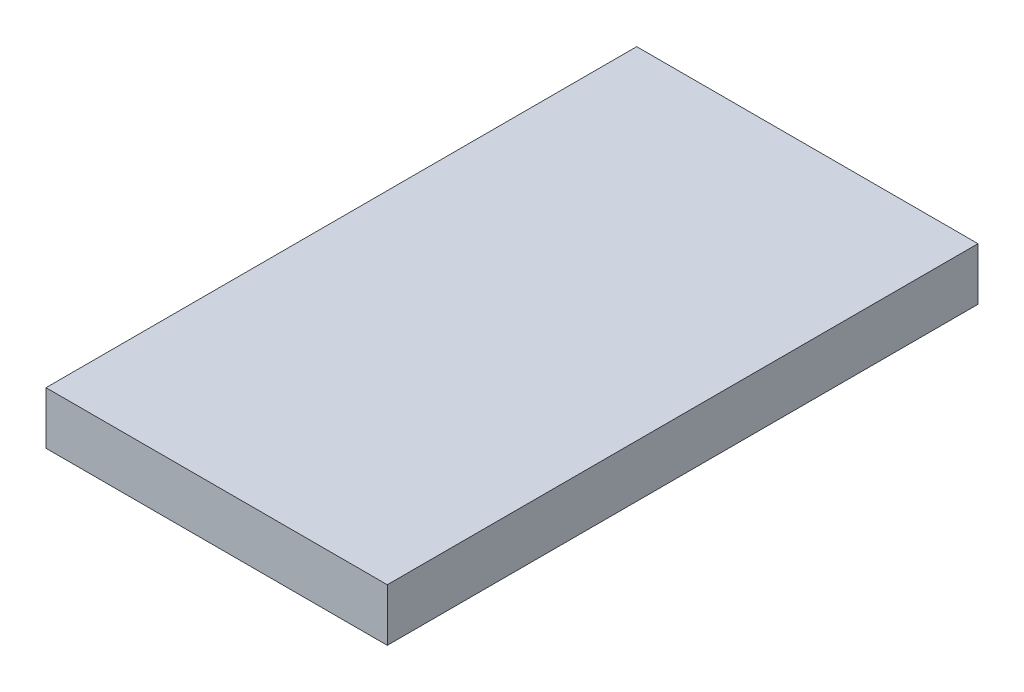
ISO-10303-21;
HEADER;
FILE_DESCRIPTION(('STEP AP214'),'2;1');
FILE_NAME('part.step','',(''),(''),'','','');
FILE_SCHEMA(('AUTOMOTIVE_DESIGN { 1 0 10303 214 1 1 1 1 }'));
ENDSEC;
DATA;
#1=APPLICATION_CONTEXT('core data for automotive mechanical design processes');
#2=APPLICATION_PROTOCOL_DEFINITION('international standard','automotive_design',2000,#1);
#3=PRODUCT_CONTEXT('',#1,'mechanical');
#4=PRODUCT('Part','Part','',(#3));
#5=PRODUCT_RELATED_PRODUCT_CATEGORY('part','',(#4));
#6=PRODUCT_DEFINITION_FORMATION('','',#4);
#7=PRODUCT_DEFINITION_CONTEXT('part definition',#1,'design');
#8=PRODUCT_DEFINITION('design','',#6,#7);
#9=PRODUCT_DEFINITION_SHAPE('','',#8);
#10=(LENGTH_UNIT() NAMED_UNIT(*) SI_UNIT(.MILLI.,.METRE.));
#11=(NAMED_UNIT(*) PLANE_ANGLE_UNIT() SI_UNIT($,.RADIAN.));
#12=(NAMED_UNIT(*) SI_UNIT($,.STERADIAN.) SOLID_ANGLE_UNIT());
#13=UNCERTAINTY_MEASURE_WITH_UNIT(LENGTH_MEASURE(1.E-05),#10,'distance_accuracy_value','');
#14=(GEOMETRIC_REPRESENTATION_CONTEXT(3) GLOBAL_UNCERTAINTY_ASSIGNED_CONTEXT((#13)) GLOBAL_UNIT_ASSIGNED_CONTEXT((#10,
#11,#12)) REPRESENTATION_CONTEXT('',''));
#15=CARTESIAN_POINT('',(0.,0.,0.));
#16=DIRECTION('',(0.,0.,1.));
#17=DIRECTION('',(1.,0.,0.));
#18=AXIS2_PLACEMENT_3D('',#15,#16,#17);
#19=CARTESIAN_POINT('',(5.2,1.6,-9.));
#20=DIRECTION('',(-1.,0.,0.));
#21=DIRECTION('',(0.,0.,1.));
#22=AXIS2_PLACEMENT_3D('',#19,#20,#21);
#23=PLANE('',#22);
#24=DIRECTION('',(0.,0.,-1.));
#25=VECTOR('',#24,1.);
#26=CARTESIAN_POINT('',(5.2,0.,-9.));
#27=LINE('',#26,#25);
#28=CARTESIAN_POINT('',(5.2,0.,9.));
#29=VERTEX_POINT('',#28);
#30=CARTESIAN_POINT('',(5.2,0.,-9.));
#31=VERTEX_POINT('',#30);
#32=EDGE_CURVE('E97',#29,#31,#27,.T.);
#33=ORIENTED_EDGE('',*,*,#32,.T.);
#34=DIRECTION('',(0.,-1.,0.));
#35=VECTOR('',#34,1.);
#36=CARTESIAN_POINT('',(5.2,1.6,-9.));
#37=LINE('',#36,#35);
#38=CARTESIAN_POINT('',(5.2,1.6,-9.));
#39=VERTEX_POINT('',#38);
#40=EDGE_CURVE('E11',#39,#31,#37,.T.);
#41=ORIENTED_EDGE('',*,*,#40,.F.);
#42=DIRECTION('',(0.,0.,-1.));
#43=VECTOR('',#42,1.);
#44=CARTESIAN_POINT('',(5.2,1.6,-9.));
#45=LINE('',#44,#43);
#46=CARTESIAN_POINT('',(5.2,1.6,9.));
#47=VERTEX_POINT('',#46);
#48=EDGE_CURVE('E85',#47,#39,#45,.T.);
#49=ORIENTED_EDGE('',*,*,#48,.F.);
#50=DIRECTION('',(0.,-1.,0.));
#51=VECTOR('',#50,1.);
#52=CARTESIAN_POINT('',(5.2,1.6,9.));
#53=LINE('',#52,#51);
#54=EDGE_CURVE('E93',#47,#29,#53,.T.);
#55=ORIENTED_EDGE('',*,*,#54,.T.);
#56=EDGE_LOOP('',(#33,#41,#49,#55));
#57=FACE_BOUND('',#56,.T.);
#58=ADVANCED_FACE('F34',(#57),#23,.F.);
#59=CARTESIAN_POINT('',(-5.2,1.6,-9.));
#60=DIRECTION('',(0.,0.,1.));
#61=DIRECTION('',(1.,0.,0.));
#62=AXIS2_PLACEMENT_3D('',#59,#60,#61);
#63=PLANE('',#62);
#64=DIRECTION('',(-1.,0.,0.));
#65=VECTOR('',#64,1.);
#66=CARTESIAN_POINT('',(-5.2,0.,-9.));
#67=LINE('',#66,#65);
#68=CARTESIAN_POINT('',(-5.2,0.,-9.));
#69=VERTEX_POINT('',#68);
#70=EDGE_CURVE('E89',#31,#69,#67,.T.);
#71=ORIENTED_EDGE('',*,*,#70,.T.);
#72=DIRECTION('',(0.,-1.,0.));
#73=VECTOR('',#72,1.);
#74=CARTESIAN_POINT('',(-5.2,1.6,-9.));
#75=LINE('',#74,#73);
#76=CARTESIAN_POINT('',(-5.2,1.6,-9.));
#77=VERTEX_POINT('',#76);
#78=EDGE_CURVE('E42',#77,#69,#75,.T.);
#79=ORIENTED_EDGE('',*,*,#78,.F.);
#80=DIRECTION('',(-1.,0.,0.));
#81=VECTOR('',#80,1.);
#82=CARTESIAN_POINT('',(-5.2,1.6,-9.));
#83=LINE('',#82,#81);
#84=EDGE_CURVE('E80',#39,#77,#83,.T.);
#85=ORIENTED_EDGE('',*,*,#84,.F.);
#86=ORIENTED_EDGE('',*,*,#40,.T.);
#87=EDGE_LOOP('',(#71,#79,#85,#86));
#88=FACE_BOUND('',#87,.T.);
#89=ADVANCED_FACE('F88',(#88),#63,.F.);
#90=CARTESIAN_POINT('',(-5.2,1.6,-9.));
#91=DIRECTION('',(1.,0.,0.));
#92=DIRECTION('',(0.,0.,-1.));
#93=AXIS2_PLACEMENT_3D('',#90,#91,#92);
#94=PLANE('',#93);
#95=DIRECTION('',(0.,0.,1.));
#96=VECTOR('',#95,1.);
#97=CARTESIAN_POINT('',(-5.2,0.,-9.));
#98=LINE('',#97,#96);
#99=CARTESIAN_POINT('',(-5.2,0.,9.));
#100=VERTEX_POINT('',#99);
#101=EDGE_CURVE('E67',#69,#100,#98,.T.);
#102=ORIENTED_EDGE('',*,*,#101,.T.);
#103=DIRECTION('',(0.,-1.,0.));
#104=VECTOR('',#103,1.);
#105=CARTESIAN_POINT('',(-5.2,1.6,9.));
#106=LINE('',#105,#104);
#107=CARTESIAN_POINT('',(-5.2,1.6,9.));
#108=VERTEX_POINT('',#107);
#109=EDGE_CURVE('E90',#108,#100,#106,.T.);
#110=ORIENTED_EDGE('',*,*,#109,.F.);
#111=DIRECTION('',(0.,0.,1.));
#112=VECTOR('',#111,1.);
#113=CARTESIAN_POINT('',(-5.2,1.6,-9.));
#114=LINE('',#113,#112);
#115=EDGE_CURVE('E83',#77,#108,#114,.T.);
#116=ORIENTED_EDGE('',*,*,#115,.F.);
#117=ORIENTED_EDGE('',*,*,#78,.T.);
#118=EDGE_LOOP('',(#102,#110,#116,#117));
#119=FACE_BOUND('',#118,.T.);
#120=ADVANCED_FACE('F91',(#119),#94,.F.);
#121=CARTESIAN_POINT('',(-5.2,1.6,9.));
#122=DIRECTION('',(0.,0.,-1.));
#123=DIRECTION('',(-1.,0.,0.));
#124=AXIS2_PLACEMENT_3D('',#121,#122,#123);
#125=PLANE('',#124);
#126=DIRECTION('',(1.,0.,0.));
#127=VECTOR('',#126,1.);
#128=CARTESIAN_POINT('',(-5.2,0.,9.));
#129=LINE('',#128,#127);
#130=EDGE_CURVE('E73',#100,#29,#129,.T.);
#131=ORIENTED_EDGE('',*,*,#130,.T.);
#132=ORIENTED_EDGE('',*,*,#54,.F.);
#133=DIRECTION('',(1.,0.,0.));
#134=VECTOR('',#133,1.);
#135=CARTESIAN_POINT('',(-5.2,1.6,9.));
#136=LINE('',#135,#134);
#137=EDGE_CURVE('E50',#108,#47,#136,.T.);
#138=ORIENTED_EDGE('',*,*,#137,.F.);
#139=ORIENTED_EDGE('',*,*,#109,.T.);
#140=EDGE_LOOP('',(#131,#132,#138,#139));
#141=FACE_BOUND('',#140,.T.);
#142=ADVANCED_FACE('F104',(#141),#125,.F.);
#143=CARTESIAN_POINT('',(0.,1.6,0.));
#144=DIRECTION('',(0.,1.,0.));
#145=DIRECTION('',(0.,0.,1.));
#146=AXIS2_PLACEMENT_3D('',#143,#144,#145);
#147=PLANE('',#146);
#148=ORIENTED_EDGE('',*,*,#48,.T.);
#149=ORIENTED_EDGE('',*,*,#84,.T.);
#150=ORIENTED_EDGE('',*,*,#115,.T.);
#151=ORIENTED_EDGE('',*,*,#137,.T.);
#152=EDGE_LOOP('',(#148,#149,#150,#151));
#153=FACE_BOUND('',#152,.T.);
#154=ADVANCED_FACE('F81',(#153),#147,.T.);
#155=CARTESIAN_POINT('',(0.,0.,0.));
#156=DIRECTION('',(0.,1.,0.));
#157=DIRECTION('',(0.,0.,1.));
#158=AXIS2_PLACEMENT_3D('',#155,#156,#157);
#159=PLANE('',#158);
#160=ORIENTED_EDGE('',*,*,#32,.F.);
#161=ORIENTED_EDGE('',*,*,#130,.F.);
#162=ORIENTED_EDGE('',*,*,#101,.F.);
#163=ORIENTED_EDGE('',*,*,#70,.F.);
#164=EDGE_LOOP('',(#160,#161,#162,#163));
#165=FACE_BOUND('',#164,.T.);
#166=ADVANCED_FACE('F107',(#165),#159,.F.);
#167=CLOSED_SHELL('',(#58,#89,#120,#142,#154,#166));
#168=MANIFOLD_SOLID_BREP('B2',#167);
#169=ADVANCED_BREP_SHAPE_REPRESENTATION('',(#18,#168),#14);
#170=SHAPE_DEFINITION_REPRESENTATION(#9,#169);
ENDSEC;
END-ISO-10303-21;
